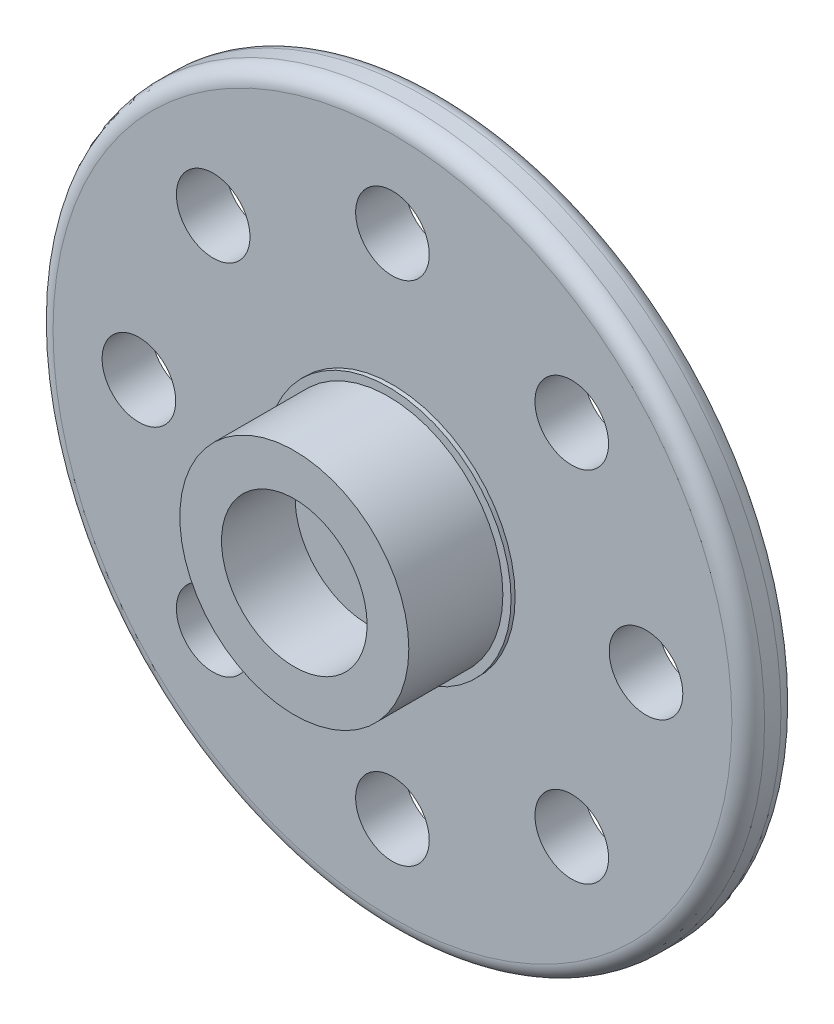
ISO-10303-21;
HEADER;
FILE_DESCRIPTION(('STEP AP214'),'2;1');
FILE_NAME('part.step','',(''),(''),'','','');
FILE_SCHEMA(('AUTOMOTIVE_DESIGN { 1 0 10303 214 1 1 1 1 }'));
ENDSEC;
DATA;
#1=APPLICATION_CONTEXT('core data for automotive mechanical design processes');
#2=APPLICATION_PROTOCOL_DEFINITION('international standard','automotive_design',2000,#1);
#3=PRODUCT_CONTEXT('',#1,'mechanical');
#4=PRODUCT('Part','Part','',(#3));
#5=PRODUCT_RELATED_PRODUCT_CATEGORY('part','',(#4));
#6=PRODUCT_DEFINITION_FORMATION('','',#4);
#7=PRODUCT_DEFINITION_CONTEXT('part definition',#1,'design');
#8=PRODUCT_DEFINITION('design','',#6,#7);
#9=PRODUCT_DEFINITION_SHAPE('','',#8);
#10=(LENGTH_UNIT() NAMED_UNIT(*) SI_UNIT(.MILLI.,.METRE.));
#11=(NAMED_UNIT(*) PLANE_ANGLE_UNIT() SI_UNIT($,.RADIAN.));
#12=(NAMED_UNIT(*) SI_UNIT($,.STERADIAN.) SOLID_ANGLE_UNIT());
#13=UNCERTAINTY_MEASURE_WITH_UNIT(LENGTH_MEASURE(1.E-05),#10,'distance_accuracy_value','');
#14=(GEOMETRIC_REPRESENTATION_CONTEXT(3) GLOBAL_UNCERTAINTY_ASSIGNED_CONTEXT((#13)) GLOBAL_UNIT_ASSIGNED_CONTEXT((#10,
#11,#12)) REPRESENTATION_CONTEXT('',''));
#15=CARTESIAN_POINT('',(0.,0.,0.));
#16=DIRECTION('',(0.,0.,1.));
#17=DIRECTION('',(1.,0.,0.));
#18=AXIS2_PLACEMENT_3D('',#15,#16,#17);
#19=CARTESIAN_POINT('',(0.,0.,24.0767275017666));
#20=DIRECTION('',(0.,0.,-1.));
#21=DIRECTION('',(-1.,0.,0.));
#22=AXIS2_PLACEMENT_3D('',#19,#20,#21);
#23=CYLINDRICAL_SURFACE('',#22,21.75);
#24=CARTESIAN_POINT('',(0.,0.,22.0767275017666));
#25=DIRECTION('',(0.,0.,1.));
#26=DIRECTION('',(1.,0.,0.));
#27=AXIS2_PLACEMENT_3D('',#24,#25,#26);
#28=CIRCLE('',#27,21.75);
#29=CARTESIAN_POINT('',(21.75,0.,22.0767275017666));
#30=VERTEX_POINT('',#29);
#31=EDGE_CURVE('E46',#30,#30,#28,.T.);
#32=ORIENTED_EDGE('',*,*,#31,.T.);
#33=EDGE_LOOP('',(#32));
#34=FACE_BOUND('',#33,.T.);
#35=CARTESIAN_POINT('',(0.,0.,23.0767275017666));
#36=DIRECTION('',(0.,0.,1.));
#37=DIRECTION('',(1.,0.,0.));
#38=AXIS2_PLACEMENT_3D('',#35,#36,#37);
#39=CIRCLE('',#38,21.75);
#40=CARTESIAN_POINT('',(21.75,0.,23.0767275017666));
#41=VERTEX_POINT('',#40);
#42=EDGE_CURVE('E50',#41,#41,#39,.F.);
#43=ORIENTED_EDGE('',*,*,#42,.T.);
#44=EDGE_LOOP('',(#43));
#45=FACE_BOUND('',#44,.T.);
#46=ADVANCED_FACE('F35',(#34,#45),#23,.T.);
#47=CARTESIAN_POINT('',(0.,0.,24.0767275017666));
#48=DIRECTION('',(0.,0.,1.));
#49=DIRECTION('',(1.,0.,0.));
#50=AXIS2_PLACEMENT_3D('',#47,#48,#49);
#51=PLANE('',#50);
#52=CARTESIAN_POINT('',(0.,0.,24.0767275017666));
#53=DIRECTION('',(0.,0.,1.));
#54=DIRECTION('',(1.,0.,0.));
#55=AXIS2_PLACEMENT_3D('',#52,#53,#54);
#56=CIRCLE('',#55,20.75);
#57=CARTESIAN_POINT('',(20.75,0.,24.0767275017666));
#58=VERTEX_POINT('',#57);
#59=EDGE_CURVE('E10',#58,#58,#56,.T.);
#60=ORIENTED_EDGE('',*,*,#59,.T.);
#61=EDGE_LOOP('',(#60));
#62=FACE_BOUND('',#61,.T.);
#63=CARTESIAN_POINT('',(0.,15.5,24.0767275017666));
#64=DIRECTION('',(0.,0.,1.));
#65=DIRECTION('',(1.,0.,0.));
#66=AXIS2_PLACEMENT_3D('',#63,#64,#65);
#67=CIRCLE('',#66,2.25);
#68=CARTESIAN_POINT('',(2.25,15.5,24.0767275017666));
#69=VERTEX_POINT('',#68);
#70=EDGE_CURVE('E109',#69,#69,#67,.T.);
#71=ORIENTED_EDGE('',*,*,#70,.F.);
#72=EDGE_LOOP('',(#71));
#73=FACE_BOUND('',#72,.T.);
#74=CARTESIAN_POINT('',(10.9601551083914,10.9601551083914,24.0767275017666));
#75=DIRECTION('',(0.,0.,1.));
#76=DIRECTION('',(1.,0.,0.));
#77=AXIS2_PLACEMENT_3D('',#74,#75,#76);
#78=CIRCLE('',#77,2.25);
#79=CARTESIAN_POINT('',(13.2101551083914,10.9601551083914,24.0767275017666));
#80=VERTEX_POINT('',#79);
#81=EDGE_CURVE('E103',#80,#80,#78,.T.);
#82=ORIENTED_EDGE('',*,*,#81,.F.);
#83=EDGE_LOOP('',(#82));
#84=FACE_BOUND('',#83,.T.);
#85=CARTESIAN_POINT('',(15.5,0.,24.0767275017666));
#86=DIRECTION('',(0.,0.,1.));
#87=DIRECTION('',(1.,0.,0.));
#88=AXIS2_PLACEMENT_3D('',#85,#86,#87);
#89=CIRCLE('',#88,2.25);
#90=CARTESIAN_POINT('',(17.75,0.,24.0767275017666));
#91=VERTEX_POINT('',#90);
#92=EDGE_CURVE('E97',#91,#91,#89,.T.);
#93=ORIENTED_EDGE('',*,*,#92,.F.);
#94=EDGE_LOOP('',(#93));
#95=FACE_BOUND('',#94,.T.);
#96=CARTESIAN_POINT('',(10.9601551083914,-10.9601551083914,24.0767275017666));
#97=DIRECTION('',(0.,0.,1.));
#98=DIRECTION('',(1.,0.,0.));
#99=AXIS2_PLACEMENT_3D('',#96,#97,#98);
#100=CIRCLE('',#99,2.24999999999999);
#101=CARTESIAN_POINT('',(13.2101551083914,-10.9601551083914,24.0767275017666));
#102=VERTEX_POINT('',#101);
#103=EDGE_CURVE('E91',#102,#102,#100,.T.);
#104=ORIENTED_EDGE('',*,*,#103,.F.);
#105=EDGE_LOOP('',(#104));
#106=FACE_BOUND('',#105,.T.);
#107=CARTESIAN_POINT('',(0.,-15.5,24.0767275017666));
#108=DIRECTION('',(0.,0.,1.));
#109=DIRECTION('',(1.,0.,0.));
#110=AXIS2_PLACEMENT_3D('',#107,#108,#109);
#111=CIRCLE('',#110,2.25);
#112=CARTESIAN_POINT('',(2.25,-15.5,24.0767275017666));
#113=VERTEX_POINT('',#112);
#114=EDGE_CURVE('E85',#113,#113,#111,.T.);
#115=ORIENTED_EDGE('',*,*,#114,.F.);
#116=EDGE_LOOP('',(#115));
#117=FACE_BOUND('',#116,.T.);
#118=CARTESIAN_POINT('',(-10.9601551083914,-10.9601551083914,24.0767275017666));
#119=DIRECTION('',(0.,0.,1.));
#120=DIRECTION('',(1.,0.,0.));
#121=AXIS2_PLACEMENT_3D('',#118,#119,#120);
#122=CIRCLE('',#121,2.25);
#123=CARTESIAN_POINT('',(-8.71015510839139,-10.9601551083914,24.0767275017666));
#124=VERTEX_POINT('',#123);
#125=EDGE_CURVE('E79',#124,#124,#122,.T.);
#126=ORIENTED_EDGE('',*,*,#125,.F.);
#127=EDGE_LOOP('',(#126));
#128=FACE_BOUND('',#127,.T.);
#129=CARTESIAN_POINT('',(-15.5,0.,24.0767275017666));
#130=DIRECTION('',(0.,0.,1.));
#131=DIRECTION('',(1.,0.,0.));
#132=AXIS2_PLACEMENT_3D('',#129,#130,#131);
#133=CIRCLE('',#132,2.25);
#134=CARTESIAN_POINT('',(-13.25,0.,24.0767275017666));
#135=VERTEX_POINT('',#134);
#136=EDGE_CURVE('E71',#135,#135,#133,.T.);
#137=ORIENTED_EDGE('',*,*,#136,.F.);
#138=EDGE_LOOP('',(#137));
#139=FACE_BOUND('',#138,.T.);
#140=CARTESIAN_POINT('',(-10.9601551083914,10.9601551083914,24.0767275017666));
#141=DIRECTION('',(0.,0.,1.));
#142=DIRECTION('',(1.,0.,0.));
#143=AXIS2_PLACEMENT_3D('',#140,#141,#142);
#144=CIRCLE('',#143,2.25);
#145=CARTESIAN_POINT('',(-8.71015510839139,10.9601551083914,24.0767275017666));
#146=VERTEX_POINT('',#145);
#147=EDGE_CURVE('E72',#146,#146,#144,.T.);
#148=ORIENTED_EDGE('',*,*,#147,.F.);
#149=EDGE_LOOP('',(#148));
#150=FACE_BOUND('',#149,.T.);
#151=CARTESIAN_POINT('',(0.,0.,24.0767275017666));
#152=DIRECTION('',(0.,0.,1.));
#153=DIRECTION('',(1.,0.,0.));
#154=AXIS2_PLACEMENT_3D('',#151,#152,#153);
#155=CIRCLE('',#154,7.5);
#156=CARTESIAN_POINT('',(7.5,0.,24.0767275017666));
#157=VERTEX_POINT('',#156);
#158=EDGE_CURVE('E56',#157,#157,#155,.T.);
#159=ORIENTED_EDGE('',*,*,#158,.F.);
#160=EDGE_LOOP('',(#159));
#161=FACE_BOUND('',#160,.T.);
#162=ADVANCED_FACE('F156',(#62,#73,#84,#95,#106,#117,#128,#139,#150,#161),#51,.T.);
#163=CARTESIAN_POINT('',(0.,0.,21.0767275017666));
#164=DIRECTION('',(0.,0.,1.));
#165=DIRECTION('',(1.,0.,0.));
#166=AXIS2_PLACEMENT_3D('',#163,#164,#165);
#167=PLANE('',#166);
#168=CARTESIAN_POINT('',(0.,0.,21.0767275017666));
#169=DIRECTION('',(0.,0.,1.));
#170=DIRECTION('',(1.,0.,0.));
#171=AXIS2_PLACEMENT_3D('',#168,#169,#170);
#172=CIRCLE('',#171,20.75);
#173=CARTESIAN_POINT('',(20.75,0.,21.0767275017666));
#174=VERTEX_POINT('',#173);
#175=EDGE_CURVE('E42',#174,#174,#172,.F.);
#176=ORIENTED_EDGE('',*,*,#175,.T.);
#177=EDGE_LOOP('',(#176));
#178=FACE_BOUND('',#177,.T.);
#179=CARTESIAN_POINT('',(0.,15.5,21.0767275017666));
#180=DIRECTION('',(0.,0.,1.));
#181=DIRECTION('',(1.,0.,0.));
#182=AXIS2_PLACEMENT_3D('',#179,#180,#181);
#183=CIRCLE('',#182,2.25);
#184=CARTESIAN_POINT('',(2.25,15.5,21.0767275017666));
#185=VERTEX_POINT('',#184);
#186=EDGE_CURVE('E67',#185,#185,#183,.F.);
#187=ORIENTED_EDGE('',*,*,#186,.F.);
#188=EDGE_LOOP('',(#187));
#189=FACE_BOUND('',#188,.T.);
#190=CARTESIAN_POINT('',(10.9601551083914,10.9601551083914,21.0767275017666));
#191=DIRECTION('',(0.,0.,1.));
#192=DIRECTION('',(1.,0.,0.));
#193=AXIS2_PLACEMENT_3D('',#190,#191,#192);
#194=CIRCLE('',#193,2.25);
#195=CARTESIAN_POINT('',(13.2101551083914,10.9601551083914,21.0767275017666));
#196=VERTEX_POINT('',#195);
#197=EDGE_CURVE('E106',#196,#196,#194,.F.);
#198=ORIENTED_EDGE('',*,*,#197,.F.);
#199=EDGE_LOOP('',(#198));
#200=FACE_BOUND('',#199,.T.);
#201=CARTESIAN_POINT('',(15.5,0.,21.0767275017666));
#202=DIRECTION('',(0.,0.,1.));
#203=DIRECTION('',(1.,0.,0.));
#204=AXIS2_PLACEMENT_3D('',#201,#202,#203);
#205=CIRCLE('',#204,2.25);
#206=CARTESIAN_POINT('',(17.75,0.,21.0767275017666));
#207=VERTEX_POINT('',#206);
#208=EDGE_CURVE('E100',#207,#207,#205,.F.);
#209=ORIENTED_EDGE('',*,*,#208,.F.);
#210=EDGE_LOOP('',(#209));
#211=FACE_BOUND('',#210,.T.);
#212=CARTESIAN_POINT('',(10.9601551083914,-10.9601551083914,21.0767275017666));
#213=DIRECTION('',(0.,0.,1.));
#214=DIRECTION('',(1.,0.,0.));
#215=AXIS2_PLACEMENT_3D('',#212,#213,#214);
#216=CIRCLE('',#215,2.24999999999999);
#217=CARTESIAN_POINT('',(13.2101551083914,-10.9601551083914,21.0767275017666));
#218=VERTEX_POINT('',#217);
#219=EDGE_CURVE('E94',#218,#218,#216,.F.);
#220=ORIENTED_EDGE('',*,*,#219,.F.);
#221=EDGE_LOOP('',(#220));
#222=FACE_BOUND('',#221,.T.);
#223=CARTESIAN_POINT('',(0.,-15.5,21.0767275017666));
#224=DIRECTION('',(0.,0.,1.));
#225=DIRECTION('',(1.,0.,0.));
#226=AXIS2_PLACEMENT_3D('',#223,#224,#225);
#227=CIRCLE('',#226,2.25);
#228=CARTESIAN_POINT('',(2.25,-15.5,21.0767275017666));
#229=VERTEX_POINT('',#228);
#230=EDGE_CURVE('E88',#229,#229,#227,.F.);
#231=ORIENTED_EDGE('',*,*,#230,.F.);
#232=EDGE_LOOP('',(#231));
#233=FACE_BOUND('',#232,.T.);
#234=CARTESIAN_POINT('',(-10.9601551083914,-10.9601551083914,21.0767275017666));
#235=DIRECTION('',(0.,0.,1.));
#236=DIRECTION('',(1.,0.,0.));
#237=AXIS2_PLACEMENT_3D('',#234,#235,#236);
#238=CIRCLE('',#237,2.25);
#239=CARTESIAN_POINT('',(-8.71015510839139,-10.9601551083914,21.0767275017666));
#240=VERTEX_POINT('',#239);
#241=EDGE_CURVE('E82',#240,#240,#238,.F.);
#242=ORIENTED_EDGE('',*,*,#241,.F.);
#243=EDGE_LOOP('',(#242));
#244=FACE_BOUND('',#243,.T.);
#245=CARTESIAN_POINT('',(-15.5,0.,21.0767275017666));
#246=DIRECTION('',(0.,0.,1.));
#247=DIRECTION('',(1.,0.,0.));
#248=AXIS2_PLACEMENT_3D('',#245,#246,#247);
#249=CIRCLE('',#248,2.25);
#250=CARTESIAN_POINT('',(-13.25,0.,21.0767275017666));
#251=VERTEX_POINT('',#250);
#252=EDGE_CURVE('E76',#251,#251,#249,.F.);
#253=ORIENTED_EDGE('',*,*,#252,.F.);
#254=EDGE_LOOP('',(#253));
#255=FACE_BOUND('',#254,.T.);
#256=CARTESIAN_POINT('',(-10.9601551083914,10.9601551083914,21.0767275017666));
#257=DIRECTION('',(0.,0.,1.));
#258=DIRECTION('',(1.,0.,0.));
#259=AXIS2_PLACEMENT_3D('',#256,#257,#258);
#260=CIRCLE('',#259,2.25);
#261=CARTESIAN_POINT('',(-8.71015510839139,10.9601551083914,21.0767275017666));
#262=VERTEX_POINT('',#261);
#263=EDGE_CURVE('E68',#262,#262,#260,.F.);
#264=ORIENTED_EDGE('',*,*,#263,.F.);
#265=EDGE_LOOP('',(#264));
#266=FACE_BOUND('',#265,.T.);
#267=ADVANCED_FACE('F152',(#178,#189,#200,#211,#222,#233,#244,#255,#266),#167,.F.);
#268=CARTESIAN_POINT('',(0.,0.,24.3267275017666));
#269=DIRECTION('',(0.,0.,-1.));
#270=DIRECTION('',(-1.,0.,0.));
#271=AXIS2_PLACEMENT_3D('',#268,#269,#270);
#272=CYLINDRICAL_SURFACE('',#271,7.5);
#273=CARTESIAN_POINT('',(0.,0.,24.3267275017666));
#274=DIRECTION('',(0.,0.,1.));
#275=DIRECTION('',(1.,0.,0.));
#276=AXIS2_PLACEMENT_3D('',#273,#274,#275);
#277=CIRCLE('',#276,7.5);
#278=CARTESIAN_POINT('',(7.5,0.,24.3267275017666));
#279=VERTEX_POINT('',#278);
#280=EDGE_CURVE('E59',#279,#279,#277,.T.);
#281=ORIENTED_EDGE('',*,*,#280,.F.);
#282=EDGE_LOOP('',(#281));
#283=FACE_BOUND('',#282,.T.);
#284=ORIENTED_EDGE('',*,*,#158,.T.);
#285=EDGE_LOOP('',(#284));
#286=FACE_BOUND('',#285,.T.);
#287=ADVANCED_FACE('F146',(#283,#286),#272,.T.);
#288=CARTESIAN_POINT('',(0.,0.,24.3267275017666));
#289=DIRECTION('',(0.,0.,1.));
#290=DIRECTION('',(1.,0.,0.));
#291=AXIS2_PLACEMENT_3D('',#288,#289,#290);
#292=PLANE('',#291);
#293=CARTESIAN_POINT('',(0.,0.,24.3267275017666));
#294=DIRECTION('',(0.,0.,1.));
#295=DIRECTION('',(1.,0.,0.));
#296=AXIS2_PLACEMENT_3D('',#293,#294,#295);
#297=CIRCLE('',#296,7.);
#298=CARTESIAN_POINT('',(7.00000000000001,0.,24.3267275017666));
#299=VERTEX_POINT('',#298);
#300=EDGE_CURVE('E55',#299,#299,#297,.T.);
#301=ORIENTED_EDGE('',*,*,#300,.F.);
#302=EDGE_LOOP('',(#301));
#303=FACE_BOUND('',#302,.T.);
#304=ORIENTED_EDGE('',*,*,#280,.T.);
#305=EDGE_LOOP('',(#304));
#306=FACE_BOUND('',#305,.T.);
#307=ADVANCED_FACE('F140',(#303,#306),#292,.T.);
#308=CARTESIAN_POINT('',(0.,0.,30.0767275017666));
#309=DIRECTION('',(0.,0.,-1.));
#310=DIRECTION('',(-1.,0.,0.));
#311=AXIS2_PLACEMENT_3D('',#308,#309,#310);
#312=CYLINDRICAL_SURFACE('',#311,7.);
#313=CARTESIAN_POINT('',(0.,0.,30.0767275017666));
#314=DIRECTION('',(0.,0.,1.));
#315=DIRECTION('',(1.,0.,0.));
#316=AXIS2_PLACEMENT_3D('',#313,#314,#315);
#317=CIRCLE('',#316,7.);
#318=CARTESIAN_POINT('',(7.00000000000001,0.,30.0767275017666));
#319=VERTEX_POINT('',#318);
#320=EDGE_CURVE('E62',#319,#319,#317,.T.);
#321=ORIENTED_EDGE('',*,*,#320,.F.);
#322=EDGE_LOOP('',(#321));
#323=FACE_BOUND('',#322,.T.);
#324=ORIENTED_EDGE('',*,*,#300,.T.);
#325=EDGE_LOOP('',(#324));
#326=FACE_BOUND('',#325,.T.);
#327=ADVANCED_FACE('F134',(#323,#326),#312,.T.);
#328=CARTESIAN_POINT('',(0.,0.,30.0767275017666));
#329=DIRECTION('',(0.,0.,1.));
#330=DIRECTION('',(1.,0.,0.));
#331=AXIS2_PLACEMENT_3D('',#328,#329,#330);
#332=PLANE('',#331);
#333=CARTESIAN_POINT('',(0.,0.,30.0767275017666));
#334=DIRECTION('',(0.,0.,1.));
#335=DIRECTION('',(1.,0.,0.));
#336=AXIS2_PLACEMENT_3D('',#333,#334,#335);
#337=CIRCLE('',#336,4.45);
#338=CARTESIAN_POINT('',(4.45,0.,30.0767275017666));
#339=VERTEX_POINT('',#338);
#340=EDGE_CURVE('E116',#339,#339,#337,.T.);
#341=ORIENTED_EDGE('',*,*,#340,.F.);
#342=EDGE_LOOP('',(#341));
#343=FACE_BOUND('',#342,.T.);
#344=ORIENTED_EDGE('',*,*,#320,.T.);
#345=EDGE_LOOP('',(#344));
#346=FACE_BOUND('',#345,.T.);
#347=ADVANCED_FACE('F130',(#343,#346),#332,.T.);
#348=CARTESIAN_POINT('',(-10.9601551083914,10.9601551083914,14.7127664710877));
#349=DIRECTION('',(0.,0.,1.));
#350=DIRECTION('',(1.,0.,0.));
#351=AXIS2_PLACEMENT_3D('',#348,#349,#350);
#352=CYLINDRICAL_SURFACE('',#351,2.25);
#353=ORIENTED_EDGE('',*,*,#263,.T.);
#354=EDGE_LOOP('',(#353));
#355=FACE_BOUND('',#354,.T.);
#356=ORIENTED_EDGE('',*,*,#147,.T.);
#357=EDGE_LOOP('',(#356));
#358=FACE_BOUND('',#357,.T.);
#359=ADVANCED_FACE('F133',(#355,#358),#352,.F.);
#360=CARTESIAN_POINT('',(-15.5,0.,14.7127664710877));
#361=DIRECTION('',(0.,0.,1.));
#362=DIRECTION('',(1.,0.,0.));
#363=AXIS2_PLACEMENT_3D('',#360,#361,#362);
#364=CYLINDRICAL_SURFACE('',#363,2.25);
#365=ORIENTED_EDGE('',*,*,#252,.T.);
#366=EDGE_LOOP('',(#365));
#367=FACE_BOUND('',#366,.T.);
#368=ORIENTED_EDGE('',*,*,#136,.T.);
#369=EDGE_LOOP('',(#368));
#370=FACE_BOUND('',#369,.T.);
#371=ADVANCED_FACE('F207',(#367,#370),#364,.F.);
#372=CARTESIAN_POINT('',(-10.9601551083914,-10.9601551083914,14.7127664710877));
#373=DIRECTION('',(0.,0.,1.));
#374=DIRECTION('',(1.,0.,0.));
#375=AXIS2_PLACEMENT_3D('',#372,#373,#374);
#376=CYLINDRICAL_SURFACE('',#375,2.25);
#377=ORIENTED_EDGE('',*,*,#241,.T.);
#378=EDGE_LOOP('',(#377));
#379=FACE_BOUND('',#378,.T.);
#380=ORIENTED_EDGE('',*,*,#125,.T.);
#381=EDGE_LOOP('',(#380));
#382=FACE_BOUND('',#381,.T.);
#383=ADVANCED_FACE('F203',(#379,#382),#376,.F.);
#384=CARTESIAN_POINT('',(0.,-15.5,14.7127664710877));
#385=DIRECTION('',(0.,0.,1.));
#386=DIRECTION('',(1.,0.,0.));
#387=AXIS2_PLACEMENT_3D('',#384,#385,#386);
#388=CYLINDRICAL_SURFACE('',#387,2.25);
#389=ORIENTED_EDGE('',*,*,#230,.T.);
#390=EDGE_LOOP('',(#389));
#391=FACE_BOUND('',#390,.T.);
#392=ORIENTED_EDGE('',*,*,#114,.T.);
#393=EDGE_LOOP('',(#392));
#394=FACE_BOUND('',#393,.T.);
#395=ADVANCED_FACE('F199',(#391,#394),#388,.F.);
#396=CARTESIAN_POINT('',(10.9601551083914,-10.9601551083914,14.7127664710877));
#397=DIRECTION('',(0.,0.,1.));
#398=DIRECTION('',(1.,0.,0.));
#399=AXIS2_PLACEMENT_3D('',#396,#397,#398);
#400=CYLINDRICAL_SURFACE('',#399,2.24999999999999);
#401=ORIENTED_EDGE('',*,*,#219,.T.);
#402=EDGE_LOOP('',(#401));
#403=FACE_BOUND('',#402,.T.);
#404=ORIENTED_EDGE('',*,*,#103,.T.);
#405=EDGE_LOOP('',(#404));
#406=FACE_BOUND('',#405,.T.);
#407=ADVANCED_FACE('F195',(#403,#406),#400,.F.);
#408=CARTESIAN_POINT('',(15.5,0.,14.7127664710877));
#409=DIRECTION('',(0.,0.,1.));
#410=DIRECTION('',(1.,0.,0.));
#411=AXIS2_PLACEMENT_3D('',#408,#409,#410);
#412=CYLINDRICAL_SURFACE('',#411,2.25);
#413=ORIENTED_EDGE('',*,*,#208,.T.);
#414=EDGE_LOOP('',(#413));
#415=FACE_BOUND('',#414,.T.);
#416=ORIENTED_EDGE('',*,*,#92,.T.);
#417=EDGE_LOOP('',(#416));
#418=FACE_BOUND('',#417,.T.);
#419=ADVANCED_FACE('F187',(#415,#418),#412,.F.);
#420=CARTESIAN_POINT('',(10.9601551083914,10.9601551083914,14.7127664710877));
#421=DIRECTION('',(0.,0.,1.));
#422=DIRECTION('',(1.,0.,0.));
#423=AXIS2_PLACEMENT_3D('',#420,#421,#422);
#424=CYLINDRICAL_SURFACE('',#423,2.25);
#425=ORIENTED_EDGE('',*,*,#197,.T.);
#426=EDGE_LOOP('',(#425));
#427=FACE_BOUND('',#426,.T.);
#428=ORIENTED_EDGE('',*,*,#81,.T.);
#429=EDGE_LOOP('',(#428));
#430=FACE_BOUND('',#429,.T.);
#431=ADVANCED_FACE('F176',(#427,#430),#424,.F.);
#432=CARTESIAN_POINT('',(0.,15.5,14.7127664710877));
#433=DIRECTION('',(0.,0.,1.));
#434=DIRECTION('',(1.,0.,0.));
#435=AXIS2_PLACEMENT_3D('',#432,#433,#434);
#436=CYLINDRICAL_SURFACE('',#435,2.25);
#437=ORIENTED_EDGE('',*,*,#186,.T.);
#438=EDGE_LOOP('',(#437));
#439=FACE_BOUND('',#438,.T.);
#440=ORIENTED_EDGE('',*,*,#70,.T.);
#441=EDGE_LOOP('',(#440));
#442=FACE_BOUND('',#441,.T.);
#443=ADVANCED_FACE('F169',(#439,#442),#436,.F.);
#444=CARTESIAN_POINT('',(0.,0.,22.0767275017666));
#445=DIRECTION('',(0.,0.,1.));
#446=DIRECTION('',(1.,0.,0.));
#447=AXIS2_PLACEMENT_3D('',#444,#445,#446);
#448=TOROIDAL_SURFACE('',#447,20.75,1.);
#449=ORIENTED_EDGE('',*,*,#175,.F.);
#450=EDGE_LOOP('',(#449));
#451=FACE_BOUND('',#450,.T.);
#452=ORIENTED_EDGE('',*,*,#31,.F.);
#453=EDGE_LOOP('',(#452));
#454=FACE_BOUND('',#453,.T.);
#455=ADVANCED_FACE('F167',(#451,#454),#448,.T.);
#456=CARTESIAN_POINT('',(0.,0.,23.0767275017666));
#457=DIRECTION('',(0.,0.,1.));
#458=DIRECTION('',(1.,0.,0.));
#459=AXIS2_PLACEMENT_3D('',#456,#457,#458);
#460=TOROIDAL_SURFACE('',#459,20.75,1.);
#461=ORIENTED_EDGE('',*,*,#42,.F.);
#462=EDGE_LOOP('',(#461));
#463=FACE_BOUND('',#462,.T.);
#464=ORIENTED_EDGE('',*,*,#59,.F.);
#465=EDGE_LOOP('',(#464));
#466=FACE_BOUND('',#465,.T.);
#467=ADVANCED_FACE('F37',(#463,#466),#460,.T.);
#468=CARTESIAN_POINT('',(0.,0.,25.5767275017666));
#469=DIRECTION('',(0.,0.,1.));
#470=DIRECTION('',(1.,0.,0.));
#471=AXIS2_PLACEMENT_3D('',#468,#469,#470);
#472=CYLINDRICAL_SURFACE('',#471,4.45);
#473=CARTESIAN_POINT('',(0.,0.,25.5767275017666));
#474=DIRECTION('',(0.,0.,1.));
#475=DIRECTION('',(1.,0.,0.));
#476=AXIS2_PLACEMENT_3D('',#473,#474,#475);
#477=CIRCLE('',#476,4.45);
#478=CARTESIAN_POINT('',(4.45,0.,25.5767275017666));
#479=VERTEX_POINT('',#478);
#480=EDGE_CURVE('E75',#479,#479,#477,.T.);
#481=ORIENTED_EDGE('',*,*,#480,.F.);
#482=EDGE_LOOP('',(#481));
#483=FACE_BOUND('',#482,.T.);
#484=ORIENTED_EDGE('',*,*,#340,.T.);
#485=EDGE_LOOP('',(#484));
#486=FACE_BOUND('',#485,.T.);
#487=ADVANCED_FACE('F124',(#483,#486),#472,.F.);
#488=CARTESIAN_POINT('',(0.,0.,25.5767275017666));
#489=DIRECTION('',(0.,0.,1.));
#490=DIRECTION('',(1.,0.,0.));
#491=AXIS2_PLACEMENT_3D('',#488,#489,#490);
#492=PLANE('',#491);
#493=ORIENTED_EDGE('',*,*,#480,.T.);
#494=EDGE_LOOP('',(#493));
#495=FACE_BOUND('',#494,.T.);
#496=ADVANCED_FACE('F122',(#495),#492,.T.);
#497=CLOSED_SHELL('',(#46,#162,#267,#287,#307,#327,#347,#359,#371,#383,#395,#407,#419,#431,#443,
#455,#467,#487,#496));
#498=MANIFOLD_SOLID_BREP('B2',#497);
#499=ADVANCED_BREP_SHAPE_REPRESENTATION('',(#18,#498),#14);
#500=SHAPE_DEFINITION_REPRESENTATION(#9,#499);
ENDSEC;
END-ISO-10303-21;
